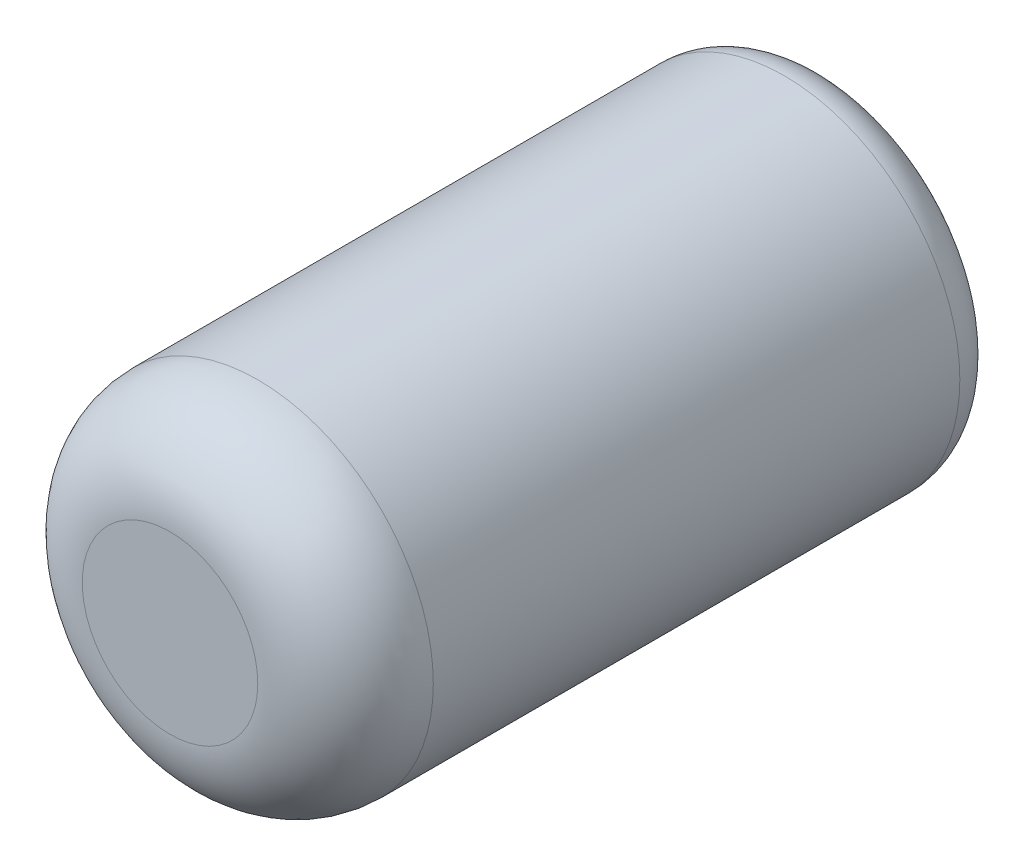
ISO-10303-21;
HEADER;
FILE_DESCRIPTION(('STEP AP214'),'2;1');
FILE_NAME('part.step','',(''),(''),'','','');
FILE_SCHEMA(('AUTOMOTIVE_DESIGN { 1 0 10303 214 1 1 1 1 }'));
ENDSEC;
DATA;
#1=APPLICATION_CONTEXT('core data for automotive mechanical design processes');
#2=APPLICATION_PROTOCOL_DEFINITION('international standard','automotive_design',2000,#1);
#3=PRODUCT_CONTEXT('',#1,'mechanical');
#4=PRODUCT('Part','Part','',(#3));
#5=PRODUCT_RELATED_PRODUCT_CATEGORY('part','',(#4));
#6=PRODUCT_DEFINITION_FORMATION('','',#4);
#7=PRODUCT_DEFINITION_CONTEXT('part definition',#1,'design');
#8=PRODUCT_DEFINITION('design','',#6,#7);
#9=PRODUCT_DEFINITION_SHAPE('','',#8);
#10=(LENGTH_UNIT() NAMED_UNIT(*) SI_UNIT(.MILLI.,.METRE.));
#11=(NAMED_UNIT(*) PLANE_ANGLE_UNIT() SI_UNIT($,.RADIAN.));
#12=(NAMED_UNIT(*) SI_UNIT($,.STERADIAN.) SOLID_ANGLE_UNIT());
#13=UNCERTAINTY_MEASURE_WITH_UNIT(LENGTH_MEASURE(1.E-05),#10,'distance_accuracy_value','');
#14=(GEOMETRIC_REPRESENTATION_CONTEXT(3) GLOBAL_UNCERTAINTY_ASSIGNED_CONTEXT((#13)) GLOBAL_UNIT_ASSIGNED_CONTEXT((#10,
#11,#12)) REPRESENTATION_CONTEXT('',''));
#15=CARTESIAN_POINT('',(0.,0.,0.));
#16=DIRECTION('',(0.,0.,1.));
#17=DIRECTION('',(1.,0.,0.));
#18=AXIS2_PLACEMENT_3D('',#15,#16,#17);
#19=CARTESIAN_POINT('',(0.,0.,15.));
#20=DIRECTION('',(0.,0.,-1.));
#21=DIRECTION('',(-1.,0.,0.));
#22=AXIS2_PLACEMENT_3D('',#19,#20,#21);
#23=CYLINDRICAL_SURFACE('',#22,4.);
#24=CARTESIAN_POINT('',(0.,0.,1.));
#25=DIRECTION('',(0.,0.,1.));
#26=DIRECTION('',(1.,0.,0.));
#27=AXIS2_PLACEMENT_3D('',#24,#25,#26);
#28=CIRCLE('',#27,4.);
#29=CARTESIAN_POINT('',(4.,0.,1.));
#30=VERTEX_POINT('',#29);
#31=EDGE_CURVE('E44',#30,#30,#28,.T.);
#32=ORIENTED_EDGE('',*,*,#31,.T.);
#33=EDGE_LOOP('',(#32));
#34=FACE_BOUND('',#33,.T.);
#35=CARTESIAN_POINT('',(0.,0.,13.));
#36=DIRECTION('',(0.,0.,1.));
#37=DIRECTION('',(1.,0.,0.));
#38=AXIS2_PLACEMENT_3D('',#35,#36,#37);
#39=CIRCLE('',#38,4.);
#40=CARTESIAN_POINT('',(4.,0.,13.));
#41=VERTEX_POINT('',#40);
#42=EDGE_CURVE('E48',#41,#41,#39,.F.);
#43=ORIENTED_EDGE('',*,*,#42,.T.);
#44=EDGE_LOOP('',(#43));
#45=FACE_BOUND('',#44,.T.);
#46=ADVANCED_FACE('F37',(#34,#45),#23,.T.);
#47=CARTESIAN_POINT('',(0.,0.,15.));
#48=DIRECTION('',(0.,0.,1.));
#49=DIRECTION('',(1.,0.,0.));
#50=AXIS2_PLACEMENT_3D('',#47,#48,#49);
#51=PLANE('',#50);
#52=CARTESIAN_POINT('',(0.,0.,15.));
#53=DIRECTION('',(0.,0.,1.));
#54=DIRECTION('',(1.,0.,0.));
#55=AXIS2_PLACEMENT_3D('',#52,#53,#54);
#56=CIRCLE('',#55,2.);
#57=CARTESIAN_POINT('',(2.,0.,15.));
#58=VERTEX_POINT('',#57);
#59=EDGE_CURVE('E52',#58,#58,#56,.T.);
#60=ORIENTED_EDGE('',*,*,#59,.T.);
#61=EDGE_LOOP('',(#60));
#62=FACE_BOUND('',#61,.T.);
#63=ADVANCED_FACE('F58',(#62),#51,.T.);
#64=CARTESIAN_POINT('',(0.,0.,0.));
#65=DIRECTION('',(0.,0.,1.));
#66=DIRECTION('',(1.,0.,0.));
#67=AXIS2_PLACEMENT_3D('',#64,#65,#66);
#68=PLANE('',#67);
#69=CARTESIAN_POINT('',(0.,0.,0.));
#70=DIRECTION('',(0.,0.,1.));
#71=DIRECTION('',(1.,0.,0.));
#72=AXIS2_PLACEMENT_3D('',#69,#70,#71);
#73=CIRCLE('',#72,3.);
#74=CARTESIAN_POINT('',(3.,0.,0.));
#75=VERTEX_POINT('',#74);
#76=EDGE_CURVE('E10',#75,#75,#73,.F.);
#77=ORIENTED_EDGE('',*,*,#76,.T.);
#78=EDGE_LOOP('',(#77));
#79=FACE_BOUND('',#78,.T.);
#80=ADVANCED_FACE('F62',(#79),#68,.F.);
#81=CARTESIAN_POINT('',(0.,0.,13.));
#82=DIRECTION('',(0.,0.,1.));
#83=DIRECTION('',(1.,0.,0.));
#84=AXIS2_PLACEMENT_3D('',#81,#82,#83);
#85=DEGENERATE_TOROIDAL_SURFACE('',#84,2.,2.,.T.);
#86=ORIENTED_EDGE('',*,*,#42,.F.);
#87=EDGE_LOOP('',(#86));
#88=FACE_BOUND('',#87,.T.);
#89=ORIENTED_EDGE('',*,*,#59,.F.);
#90=EDGE_LOOP('',(#89));
#91=FACE_BOUND('',#90,.T.);
#92=ADVANCED_FACE('F60',(#88,#91),#85,.T.);
#93=CARTESIAN_POINT('',(0.,0.,1.));
#94=DIRECTION('',(0.,0.,1.));
#95=DIRECTION('',(1.,0.,0.));
#96=AXIS2_PLACEMENT_3D('',#93,#94,#95);
#97=TOROIDAL_SURFACE('',#96,3.,1.);
#98=ORIENTED_EDGE('',*,*,#76,.F.);
#99=EDGE_LOOP('',(#98));
#100=FACE_BOUND('',#99,.T.);
#101=ORIENTED_EDGE('',*,*,#31,.F.);
#102=EDGE_LOOP('',(#101));
#103=FACE_BOUND('',#102,.T.);
#104=ADVANCED_FACE('F39',(#100,#103),#97,.T.);
#105=CLOSED_SHELL('',(#46,#63,#80,#92,#104));
#106=MANIFOLD_SOLID_BREP('B2',#105);
#107=ADVANCED_BREP_SHAPE_REPRESENTATION('',(#18,#106),#14);
#108=SHAPE_DEFINITION_REPRESENTATION(#9,#107);
ENDSEC;
END-ISO-10303-21;
